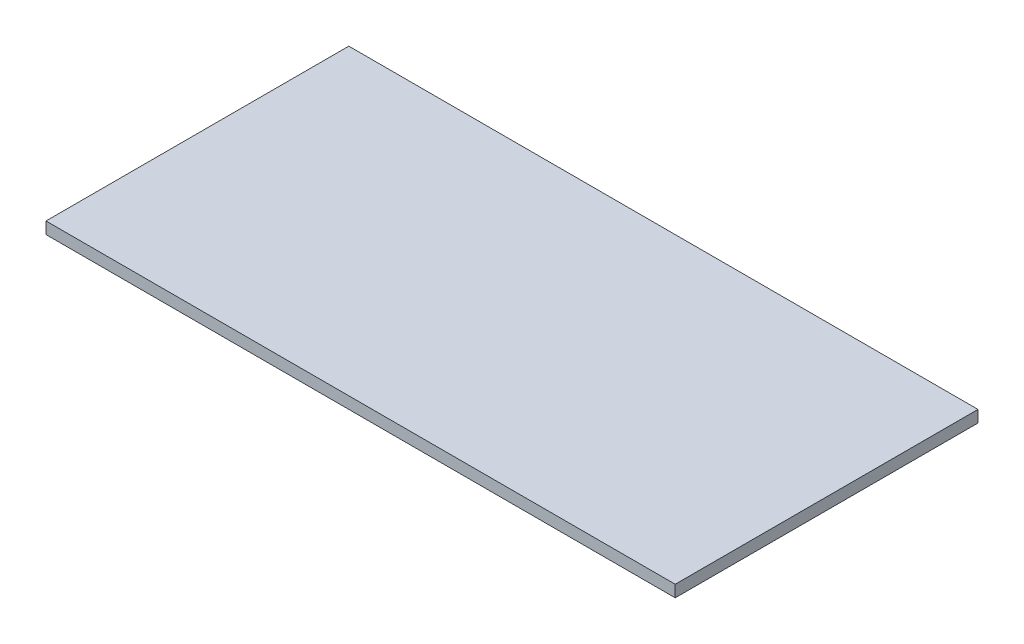
ISO-10303-21;
HEADER;
FILE_DESCRIPTION(('STEP AP214'),'2;1');
FILE_NAME('part.step','',(''),(''),'','','');
FILE_SCHEMA(('AUTOMOTIVE_DESIGN { 1 0 10303 214 1 1 1 1 }'));
ENDSEC;
DATA;
#1=APPLICATION_CONTEXT('core data for automotive mechanical design processes');
#2=APPLICATION_PROTOCOL_DEFINITION('international standard','automotive_design',2000,#1);
#3=PRODUCT_CONTEXT('',#1,'mechanical');
#4=PRODUCT('Part','Part','',(#3));
#5=PRODUCT_RELATED_PRODUCT_CATEGORY('part','',(#4));
#6=PRODUCT_DEFINITION_FORMATION('','',#4);
#7=PRODUCT_DEFINITION_CONTEXT('part definition',#1,'design');
#8=PRODUCT_DEFINITION('design','',#6,#7);
#9=PRODUCT_DEFINITION_SHAPE('','',#8);
#10=(LENGTH_UNIT() NAMED_UNIT(*) SI_UNIT(.MILLI.,.METRE.));
#11=(NAMED_UNIT(*) PLANE_ANGLE_UNIT() SI_UNIT($,.RADIAN.));
#12=(NAMED_UNIT(*) SI_UNIT($,.STERADIAN.) SOLID_ANGLE_UNIT());
#13=UNCERTAINTY_MEASURE_WITH_UNIT(LENGTH_MEASURE(1.E-05),#10,'distance_accuracy_value','');
#14=(GEOMETRIC_REPRESENTATION_CONTEXT(3) GLOBAL_UNCERTAINTY_ASSIGNED_CONTEXT((#13)) GLOBAL_UNIT_ASSIGNED_CONTEXT((#10,
#11,#12)) REPRESENTATION_CONTEXT('',''));
#15=CARTESIAN_POINT('',(0.,0.,0.));
#16=DIRECTION('',(0.,0.,1.));
#17=DIRECTION('',(1.,0.,0.));
#18=AXIS2_PLACEMENT_3D('',#15,#16,#17);
#19=CARTESIAN_POINT('',(508.,-19.05,244.475));
#20=DIRECTION('',(1.,0.,0.));
#21=DIRECTION('',(0.,0.,-1.));
#22=AXIS2_PLACEMENT_3D('',#19,#20,#21);
#23=PLANE('',#22);
#24=DIRECTION('',(0.,0.,-1.));
#25=VECTOR('',#24,1.);
#26=CARTESIAN_POINT('',(508.,0.,244.475));
#27=LINE('',#26,#25);
#28=CARTESIAN_POINT('',(508.,0.,244.475));
#29=VERTEX_POINT('',#28);
#30=CARTESIAN_POINT('',(508.,0.,-244.475));
#31=VERTEX_POINT('',#30);
#32=EDGE_CURVE('E98',#29,#31,#27,.T.);
#33=ORIENTED_EDGE('',*,*,#32,.F.);
#34=DIRECTION('',(0.,1.,0.));
#35=VECTOR('',#34,1.);
#36=CARTESIAN_POINT('',(508.,-19.05,244.475));
#37=LINE('',#36,#35);
#38=CARTESIAN_POINT('',(508.,-19.05,244.475));
#39=VERTEX_POINT('',#38);
#40=EDGE_CURVE('E11',#39,#29,#37,.T.);
#41=ORIENTED_EDGE('',*,*,#40,.F.);
#42=DIRECTION('',(0.,0.,-1.));
#43=VECTOR('',#42,1.);
#44=CARTESIAN_POINT('',(508.,-19.05,244.475));
#45=LINE('',#44,#43);
#46=CARTESIAN_POINT('',(508.,-19.05,-244.475));
#47=VERTEX_POINT('',#46);
#48=EDGE_CURVE('E92',#39,#47,#45,.T.);
#49=ORIENTED_EDGE('',*,*,#48,.T.);
#50=DIRECTION('',(0.,1.,0.));
#51=VECTOR('',#50,1.);
#52=CARTESIAN_POINT('',(508.,-19.05,-244.475));
#53=LINE('',#52,#51);
#54=EDGE_CURVE('E37',#47,#31,#53,.T.);
#55=ORIENTED_EDGE('',*,*,#54,.T.);
#56=EDGE_LOOP('',(#33,#41,#49,#55));
#57=FACE_BOUND('',#56,.T.);
#58=ADVANCED_FACE('F34',(#57),#23,.T.);
#59=CARTESIAN_POINT('',(-508.,-19.05,244.475));
#60=DIRECTION('',(0.,0.,1.));
#61=DIRECTION('',(1.,0.,0.));
#62=AXIS2_PLACEMENT_3D('',#59,#60,#61);
#63=PLANE('',#62);
#64=DIRECTION('',(1.,0.,0.));
#65=VECTOR('',#64,1.);
#66=CARTESIAN_POINT('',(-508.,0.,244.475));
#67=LINE('',#66,#65);
#68=CARTESIAN_POINT('',(-508.,0.,244.475));
#69=VERTEX_POINT('',#68);
#70=EDGE_CURVE('E94',#69,#29,#67,.T.);
#71=ORIENTED_EDGE('',*,*,#70,.F.);
#72=DIRECTION('',(0.,1.,0.));
#73=VECTOR('',#72,1.);
#74=CARTESIAN_POINT('',(-508.,-19.05,244.475));
#75=LINE('',#74,#73);
#76=CARTESIAN_POINT('',(-508.,-19.05,244.475));
#77=VERTEX_POINT('',#76);
#78=EDGE_CURVE('E43',#77,#69,#75,.T.);
#79=ORIENTED_EDGE('',*,*,#78,.F.);
#80=DIRECTION('',(1.,0.,0.));
#81=VECTOR('',#80,1.);
#82=CARTESIAN_POINT('',(-508.,-19.05,244.475));
#83=LINE('',#82,#81);
#84=EDGE_CURVE('E89',#77,#39,#83,.T.);
#85=ORIENTED_EDGE('',*,*,#84,.T.);
#86=ORIENTED_EDGE('',*,*,#40,.T.);
#87=EDGE_LOOP('',(#71,#79,#85,#86));
#88=FACE_BOUND('',#87,.T.);
#89=ADVANCED_FACE('F108',(#88),#63,.T.);
#90=CARTESIAN_POINT('',(-508.,-19.05,244.475));
#91=DIRECTION('',(-1.,0.,0.));
#92=DIRECTION('',(0.,0.,1.));
#93=AXIS2_PLACEMENT_3D('',#90,#91,#92);
#94=PLANE('',#93);
#95=DIRECTION('',(0.,0.,1.));
#96=VECTOR('',#95,1.);
#97=CARTESIAN_POINT('',(-508.,0.,244.475));
#98=LINE('',#97,#96);
#99=CARTESIAN_POINT('',(-508.,0.,-244.475));
#100=VERTEX_POINT('',#99);
#101=EDGE_CURVE('E84',#100,#69,#98,.T.);
#102=ORIENTED_EDGE('',*,*,#101,.F.);
#103=DIRECTION('',(0.,1.,0.));
#104=VECTOR('',#103,1.);
#105=CARTESIAN_POINT('',(-508.,-19.05,-244.475));
#106=LINE('',#105,#104);
#107=CARTESIAN_POINT('',(-508.,-19.05,-244.475));
#108=VERTEX_POINT('',#107);
#109=EDGE_CURVE('E79',#108,#100,#106,.T.);
#110=ORIENTED_EDGE('',*,*,#109,.F.);
#111=DIRECTION('',(0.,0.,1.));
#112=VECTOR('',#111,1.);
#113=CARTESIAN_POINT('',(-508.,-19.05,244.475));
#114=LINE('',#113,#112);
#115=EDGE_CURVE('E82',#108,#77,#114,.T.);
#116=ORIENTED_EDGE('',*,*,#115,.T.);
#117=ORIENTED_EDGE('',*,*,#78,.T.);
#118=EDGE_LOOP('',(#102,#110,#116,#117));
#119=FACE_BOUND('',#118,.T.);
#120=ADVANCED_FACE('F81',(#119),#94,.T.);
#121=CARTESIAN_POINT('',(-508.,-19.05,-244.475));
#122=DIRECTION('',(0.,0.,-1.));
#123=DIRECTION('',(-1.,0.,0.));
#124=AXIS2_PLACEMENT_3D('',#121,#122,#123);
#125=PLANE('',#124);
#126=DIRECTION('',(-1.,0.,0.));
#127=VECTOR('',#126,1.);
#128=CARTESIAN_POINT('',(-508.,0.,-244.475));
#129=LINE('',#128,#127);
#130=EDGE_CURVE('E101',#31,#100,#129,.T.);
#131=ORIENTED_EDGE('',*,*,#130,.F.);
#132=ORIENTED_EDGE('',*,*,#54,.F.);
#133=DIRECTION('',(-1.,0.,0.));
#134=VECTOR('',#133,1.);
#135=CARTESIAN_POINT('',(-508.,-19.05,-244.475));
#136=LINE('',#135,#134);
#137=EDGE_CURVE('E88',#47,#108,#136,.T.);
#138=ORIENTED_EDGE('',*,*,#137,.T.);
#139=ORIENTED_EDGE('',*,*,#109,.T.);
#140=EDGE_LOOP('',(#131,#132,#138,#139));
#141=FACE_BOUND('',#140,.T.);
#142=ADVANCED_FACE('F91',(#141),#125,.T.);
#143=CARTESIAN_POINT('',(0.,-19.05,0.));
#144=DIRECTION('',(0.,-1.,0.));
#145=DIRECTION('',(0.,0.,-1.));
#146=AXIS2_PLACEMENT_3D('',#143,#144,#145);
#147=PLANE('',#146);
#148=ORIENTED_EDGE('',*,*,#48,.F.);
#149=ORIENTED_EDGE('',*,*,#84,.F.);
#150=ORIENTED_EDGE('',*,*,#115,.F.);
#151=ORIENTED_EDGE('',*,*,#137,.F.);
#152=EDGE_LOOP('',(#148,#149,#150,#151));
#153=FACE_BOUND('',#152,.T.);
#154=ADVANCED_FACE('F87',(#153),#147,.T.);
#155=CARTESIAN_POINT('',(0.,0.,0.));
#156=DIRECTION('',(0.,-1.,0.));
#157=DIRECTION('',(0.,0.,-1.));
#158=AXIS2_PLACEMENT_3D('',#155,#156,#157);
#159=PLANE('',#158);
#160=ORIENTED_EDGE('',*,*,#32,.T.);
#161=ORIENTED_EDGE('',*,*,#130,.T.);
#162=ORIENTED_EDGE('',*,*,#101,.T.);
#163=ORIENTED_EDGE('',*,*,#70,.T.);
#164=EDGE_LOOP('',(#160,#161,#162,#163));
#165=FACE_BOUND('',#164,.T.);
#166=ADVANCED_FACE('F107',(#165),#159,.F.);
#167=CLOSED_SHELL('',(#58,#89,#120,#142,#154,#166));
#168=MANIFOLD_SOLID_BREP('B2',#167);
#169=ADVANCED_BREP_SHAPE_REPRESENTATION('',(#18,#168),#14);
#170=SHAPE_DEFINITION_REPRESENTATION(#9,#169);
ENDSEC;
END-ISO-10303-21;
